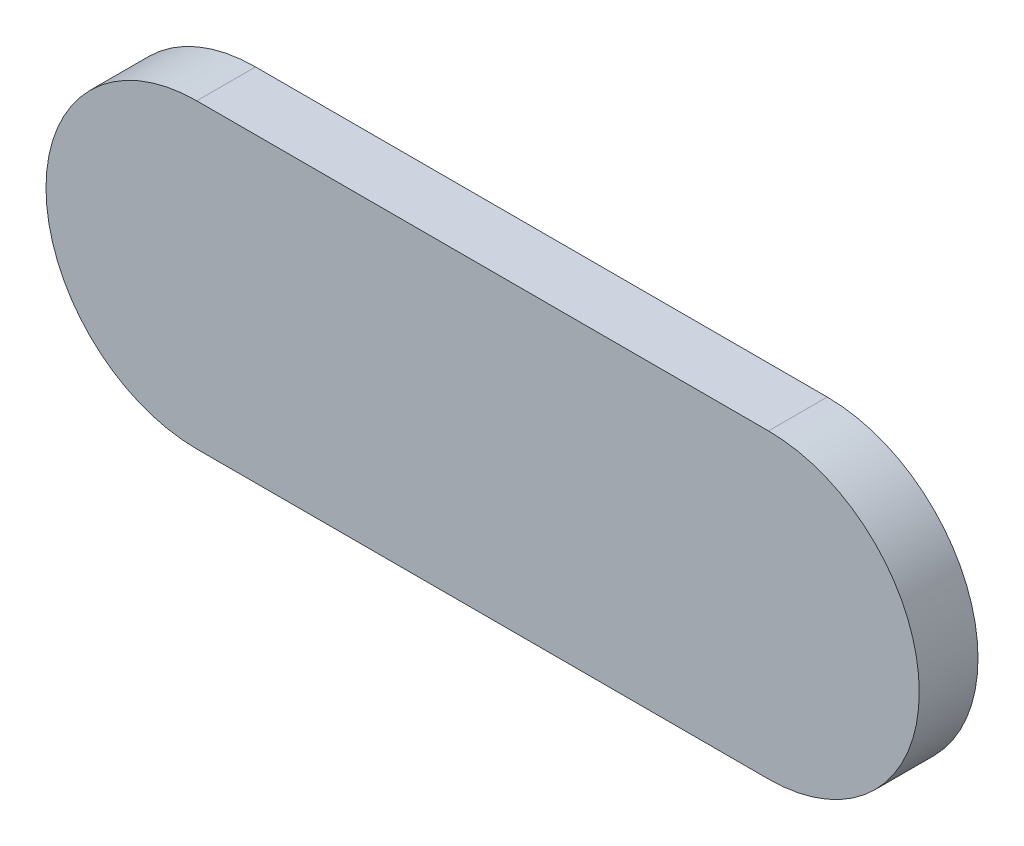
ISO-10303-21;
HEADER;
FILE_DESCRIPTION(('STEP AP214'),'2;1');
FILE_NAME('part.step','',(''),(''),'','','');
FILE_SCHEMA(('AUTOMOTIVE_DESIGN { 1 0 10303 214 1 1 1 1 }'));
ENDSEC;
DATA;
#1=APPLICATION_CONTEXT('core data for automotive mechanical design processes');
#2=APPLICATION_PROTOCOL_DEFINITION('international standard','automotive_design',2000,#1);
#3=PRODUCT_CONTEXT('',#1,'mechanical');
#4=PRODUCT('Part','Part','',(#3));
#5=PRODUCT_RELATED_PRODUCT_CATEGORY('part','',(#4));
#6=PRODUCT_DEFINITION_FORMATION('','',#4);
#7=PRODUCT_DEFINITION_CONTEXT('part definition',#1,'design');
#8=PRODUCT_DEFINITION('design','',#6,#7);
#9=PRODUCT_DEFINITION_SHAPE('','',#8);
#10=(LENGTH_UNIT() NAMED_UNIT(*) SI_UNIT(.MILLI.,.METRE.));
#11=(NAMED_UNIT(*) PLANE_ANGLE_UNIT() SI_UNIT($,.RADIAN.));
#12=(NAMED_UNIT(*) SI_UNIT($,.STERADIAN.) SOLID_ANGLE_UNIT());
#13=UNCERTAINTY_MEASURE_WITH_UNIT(LENGTH_MEASURE(1.E-05),#10,'distance_accuracy_value','');
#14=(GEOMETRIC_REPRESENTATION_CONTEXT(3) GLOBAL_UNCERTAINTY_ASSIGNED_CONTEXT((#13)) GLOBAL_UNIT_ASSIGNED_CONTEXT((#10,
#11,#12)) REPRESENTATION_CONTEXT('',''));
#15=CARTESIAN_POINT('',(0.,0.,0.));
#16=DIRECTION('',(0.,0.,1.));
#17=DIRECTION('',(1.,0.,0.));
#18=AXIS2_PLACEMENT_3D('',#15,#16,#17);
#19=CARTESIAN_POINT('',(7.3,0.,0.));
#20=DIRECTION('',(0.,0.,1.));
#21=DIRECTION('',(1.,0.,0.));
#22=AXIS2_PLACEMENT_3D('',#19,#20,#21);
#23=PLANE('',#22);
#24=CARTESIAN_POINT('',(7.3,0.,0.));
#25=DIRECTION('',(0.,0.,1.));
#26=DIRECTION('',(1.,0.,0.));
#27=AXIS2_PLACEMENT_3D('',#24,#25,#26);
#28=CIRCLE('',#27,3.85);
#29=CARTESIAN_POINT('',(7.3,-3.85,0.));
#30=VERTEX_POINT('',#29);
#31=CARTESIAN_POINT('',(7.3,3.85,0.));
#32=VERTEX_POINT('',#31);
#33=EDGE_CURVE('E121',#30,#32,#28,.T.);
#34=ORIENTED_EDGE('',*,*,#33,.F.);
#35=DIRECTION('',(1.,0.,0.));
#36=VECTOR('',#35,1.);
#37=CARTESIAN_POINT('',(-7.3,-3.85,0.));
#38=LINE('',#37,#36);
#39=CARTESIAN_POINT('',(-7.3,-3.85,0.));
#40=VERTEX_POINT('',#39);
#41=EDGE_CURVE('E134',#40,#30,#38,.T.);
#42=ORIENTED_EDGE('',*,*,#41,.F.);
#43=CARTESIAN_POINT('',(-7.3,0.,0.));
#44=DIRECTION('',(0.,0.,1.));
#45=DIRECTION('',(1.,0.,0.));
#46=AXIS2_PLACEMENT_3D('',#43,#44,#45);
#47=CIRCLE('',#46,3.85);
#48=CARTESIAN_POINT('',(-7.3,3.85,0.));
#49=VERTEX_POINT('',#48);
#50=EDGE_CURVE('E142',#49,#40,#47,.T.);
#51=ORIENTED_EDGE('',*,*,#50,.F.);
#52=DIRECTION('',(-1.,0.,0.));
#53=VECTOR('',#52,1.);
#54=CARTESIAN_POINT('',(7.3,3.85,0.));
#55=LINE('',#54,#53);
#56=EDGE_CURVE('E124',#32,#49,#55,.T.);
#57=ORIENTED_EDGE('',*,*,#56,.F.);
#58=EDGE_LOOP('',(#34,#42,#51,#57));
#59=FACE_BOUND('',#58,.T.);
#60=CARTESIAN_POINT('',(7.35,0.,0.));
#61=DIRECTION('',(0.,0.,-1.));
#62=DIRECTION('',(1.,0.,0.));
#63=AXIS2_PLACEMENT_3D('',#60,#61,#62);
#64=CIRCLE('',#63,2.3);
#65=CARTESIAN_POINT('',(7.35,2.3,0.));
#66=VERTEX_POINT('',#65);
#67=CARTESIAN_POINT('',(7.35,-2.3,0.));
#68=VERTEX_POINT('',#67);
#69=EDGE_CURVE('E51',#66,#68,#64,.T.);
#70=ORIENTED_EDGE('',*,*,#69,.F.);
#71=DIRECTION('',(1.,0.,0.));
#72=VECTOR('',#71,1.);
#73=CARTESIAN_POINT('',(7.35,2.3,0.));
#74=LINE('',#73,#72);
#75=CARTESIAN_POINT('',(-7.35,2.3,0.));
#76=VERTEX_POINT('',#75);
#77=EDGE_CURVE('E55',#76,#66,#74,.T.);
#78=ORIENTED_EDGE('',*,*,#77,.F.);
#79=CARTESIAN_POINT('',(-7.35,0.,0.));
#80=DIRECTION('',(0.,0.,-1.));
#81=DIRECTION('',(-1.,0.,0.));
#82=AXIS2_PLACEMENT_3D('',#79,#80,#81);
#83=CIRCLE('',#82,2.3);
#84=CARTESIAN_POINT('',(-7.35,-2.3,0.));
#85=VERTEX_POINT('',#84);
#86=EDGE_CURVE('E241',#85,#76,#83,.T.);
#87=ORIENTED_EDGE('',*,*,#86,.F.);
#88=DIRECTION('',(-1.,0.,0.));
#89=VECTOR('',#88,1.);
#90=CARTESIAN_POINT('',(7.35,-2.3,0.));
#91=LINE('',#90,#89);
#92=EDGE_CURVE('E247',#68,#85,#91,.T.);
#93=ORIENTED_EDGE('',*,*,#92,.F.);
#94=EDGE_LOOP('',(#70,#78,#87,#93));
#95=FACE_BOUND('',#94,.T.);
#96=ADVANCED_FACE('F36',(#59,#95),#23,.F.);
#97=CARTESIAN_POINT('',(7.3,0.,1.5));
#98=DIRECTION('',(0.,0.,-1.));
#99=DIRECTION('',(-1.,0.,0.));
#100=AXIS2_PLACEMENT_3D('',#97,#98,#99);
#101=CYLINDRICAL_SURFACE('',#100,3.85);
#102=ORIENTED_EDGE('',*,*,#33,.T.);
#103=DIRECTION('',(0.,0.,-1.));
#104=VECTOR('',#103,1.);
#105=CARTESIAN_POINT('',(7.3,3.85,1.5));
#106=LINE('',#105,#104);
#107=CARTESIAN_POINT('',(7.3,3.85,1.5));
#108=VERTEX_POINT('',#107);
#109=EDGE_CURVE('E153',#108,#32,#106,.T.);
#110=ORIENTED_EDGE('',*,*,#109,.F.);
#111=CARTESIAN_POINT('',(7.3,0.,1.5));
#112=DIRECTION('',(0.,0.,1.));
#113=DIRECTION('',(1.,0.,0.));
#114=AXIS2_PLACEMENT_3D('',#111,#112,#113);
#115=CIRCLE('',#114,3.85);
#116=CARTESIAN_POINT('',(7.3,-3.85,1.5));
#117=VERTEX_POINT('',#116);
#118=EDGE_CURVE('E130',#117,#108,#115,.T.);
#119=ORIENTED_EDGE('',*,*,#118,.F.);
#120=DIRECTION('',(0.,0.,-1.));
#121=VECTOR('',#120,1.);
#122=CARTESIAN_POINT('',(7.3,-3.85,1.5));
#123=LINE('',#122,#121);
#124=EDGE_CURVE('E139',#117,#30,#123,.T.);
#125=ORIENTED_EDGE('',*,*,#124,.T.);
#126=EDGE_LOOP('',(#102,#110,#119,#125));
#127=FACE_BOUND('',#126,.T.);
#128=ADVANCED_FACE('F38',(#127),#101,.T.);
#129=CARTESIAN_POINT('',(7.3,3.85,1.5));
#130=DIRECTION('',(0.,-1.,0.));
#131=DIRECTION('',(1.,0.,0.));
#132=AXIS2_PLACEMENT_3D('',#129,#130,#131);
#133=PLANE('',#132);
#134=ORIENTED_EDGE('',*,*,#56,.T.);
#135=DIRECTION('',(0.,0.,-1.));
#136=VECTOR('',#135,1.);
#137=CARTESIAN_POINT('',(-7.3,3.85,1.5));
#138=LINE('',#137,#136);
#139=CARTESIAN_POINT('',(-7.3,3.85,1.5));
#140=VERTEX_POINT('',#139);
#141=EDGE_CURVE('E150',#140,#49,#138,.T.);
#142=ORIENTED_EDGE('',*,*,#141,.F.);
#143=DIRECTION('',(-1.,0.,0.));
#144=VECTOR('',#143,1.);
#145=CARTESIAN_POINT('',(7.3,3.85,1.5));
#146=LINE('',#145,#144);
#147=EDGE_CURVE('E133',#108,#140,#146,.T.);
#148=ORIENTED_EDGE('',*,*,#147,.F.);
#149=ORIENTED_EDGE('',*,*,#109,.T.);
#150=EDGE_LOOP('',(#134,#142,#148,#149));
#151=FACE_BOUND('',#150,.T.);
#152=ADVANCED_FACE('F193',(#151),#133,.F.);
#153=CARTESIAN_POINT('',(-7.3,0.,1.5));
#154=DIRECTION('',(0.,0.,-1.));
#155=DIRECTION('',(-1.,0.,0.));
#156=AXIS2_PLACEMENT_3D('',#153,#154,#155);
#157=CYLINDRICAL_SURFACE('',#156,3.85);
#158=ORIENTED_EDGE('',*,*,#50,.T.);
#159=DIRECTION('',(0.,0.,-1.));
#160=VECTOR('',#159,1.);
#161=CARTESIAN_POINT('',(-7.3,-3.85,1.5));
#162=LINE('',#161,#160);
#163=CARTESIAN_POINT('',(-7.3,-3.85,1.5));
#164=VERTEX_POINT('',#163);
#165=EDGE_CURVE('E147',#164,#40,#162,.T.);
#166=ORIENTED_EDGE('',*,*,#165,.F.);
#167=CARTESIAN_POINT('',(-7.3,0.,1.5));
#168=DIRECTION('',(0.,0.,1.));
#169=DIRECTION('',(1.,0.,0.));
#170=AXIS2_PLACEMENT_3D('',#167,#168,#169);
#171=CIRCLE('',#170,3.85);
#172=EDGE_CURVE('E136',#140,#164,#171,.T.);
#173=ORIENTED_EDGE('',*,*,#172,.F.);
#174=ORIENTED_EDGE('',*,*,#141,.T.);
#175=EDGE_LOOP('',(#158,#166,#173,#174));
#176=FACE_BOUND('',#175,.T.);
#177=ADVANCED_FACE('F203',(#176),#157,.T.);
#178=CARTESIAN_POINT('',(-7.3,-3.85,1.5));
#179=DIRECTION('',(0.,1.,0.));
#180=DIRECTION('',(0.,0.,1.));
#181=AXIS2_PLACEMENT_3D('',#178,#179,#180);
#182=PLANE('',#181);
#183=ORIENTED_EDGE('',*,*,#41,.T.);
#184=ORIENTED_EDGE('',*,*,#124,.F.);
#185=DIRECTION('',(1.,0.,0.));
#186=VECTOR('',#185,1.);
#187=CARTESIAN_POINT('',(-7.3,-3.85,1.5));
#188=LINE('',#187,#186);
#189=EDGE_CURVE('E138',#164,#117,#188,.T.);
#190=ORIENTED_EDGE('',*,*,#189,.F.);
#191=ORIENTED_EDGE('',*,*,#165,.T.);
#192=EDGE_LOOP('',(#183,#184,#190,#191));
#193=FACE_BOUND('',#192,.T.);
#194=ADVANCED_FACE('F200',(#193),#182,.F.);
#195=CARTESIAN_POINT('',(7.3,0.,1.5));
#196=DIRECTION('',(0.,0.,1.));
#197=DIRECTION('',(1.,0.,0.));
#198=AXIS2_PLACEMENT_3D('',#195,#196,#197);
#199=PLANE('',#198);
#200=ORIENTED_EDGE('',*,*,#118,.T.);
#201=ORIENTED_EDGE('',*,*,#147,.T.);
#202=ORIENTED_EDGE('',*,*,#172,.T.);
#203=ORIENTED_EDGE('',*,*,#189,.T.);
#204=EDGE_LOOP('',(#200,#201,#202,#203));
#205=FACE_BOUND('',#204,.T.);
#206=ADVANCED_FACE('F198',(#205),#199,.T.);
#207=CARTESIAN_POINT('',(7.35,0.,-0.5));
#208=DIRECTION('',(0.,0.,1.));
#209=DIRECTION('',(1.,0.,0.));
#210=AXIS2_PLACEMENT_3D('',#207,#208,#209);
#211=CYLINDRICAL_SURFACE('',#210,2.3);
#212=ORIENTED_EDGE('',*,*,#69,.T.);
#213=DIRECTION('',(0.,0.,1.));
#214=VECTOR('',#213,1.);
#215=CARTESIAN_POINT('',(7.35,-2.3,-0.5));
#216=LINE('',#215,#214);
#217=CARTESIAN_POINT('',(7.35,-2.3,-0.5));
#218=VERTEX_POINT('',#217);
#219=EDGE_CURVE('E104',#218,#68,#216,.T.);
#220=ORIENTED_EDGE('',*,*,#219,.F.);
#221=CARTESIAN_POINT('',(7.35,0.,-0.5));
#222=DIRECTION('',(0.,0.,-1.));
#223=DIRECTION('',(1.,0.,0.));
#224=AXIS2_PLACEMENT_3D('',#221,#222,#223);
#225=CIRCLE('',#224,2.3);
#226=CARTESIAN_POINT('',(7.35,2.3,-0.5));
#227=VERTEX_POINT('',#226);
#228=EDGE_CURVE('E110',#227,#218,#225,.T.);
#229=ORIENTED_EDGE('',*,*,#228,.F.);
#230=DIRECTION('',(0.,0.,1.));
#231=VECTOR('',#230,1.);
#232=CARTESIAN_POINT('',(7.35,2.3,-0.5));
#233=LINE('',#232,#231);
#234=EDGE_CURVE('E239',#227,#66,#233,.T.);
#235=ORIENTED_EDGE('',*,*,#234,.T.);
#236=EDGE_LOOP('',(#212,#220,#229,#235));
#237=FACE_BOUND('',#236,.T.);
#238=ADVANCED_FACE('F120',(#237),#211,.T.);
#239=CARTESIAN_POINT('',(7.35,-2.3,-0.5));
#240=DIRECTION('',(0.,1.,0.));
#241=DIRECTION('',(0.,0.,1.));
#242=AXIS2_PLACEMENT_3D('',#239,#240,#241);
#243=PLANE('',#242);
#244=ORIENTED_EDGE('',*,*,#92,.T.);
#245=DIRECTION('',(0.,0.,1.));
#246=VECTOR('',#245,1.);
#247=CARTESIAN_POINT('',(-7.35,-2.3,-0.5));
#248=LINE('',#247,#246);
#249=CARTESIAN_POINT('',(-7.35,-2.3,-0.5));
#250=VERTEX_POINT('',#249);
#251=EDGE_CURVE('E106',#250,#85,#248,.T.);
#252=ORIENTED_EDGE('',*,*,#251,.F.);
#253=DIRECTION('',(-1.,0.,0.));
#254=VECTOR('',#253,1.);
#255=CARTESIAN_POINT('',(7.35,-2.3,-0.5));
#256=LINE('',#255,#254);
#257=EDGE_CURVE('E99',#218,#250,#256,.T.);
#258=ORIENTED_EDGE('',*,*,#257,.F.);
#259=ORIENTED_EDGE('',*,*,#219,.T.);
#260=EDGE_LOOP('',(#244,#252,#258,#259));
#261=FACE_BOUND('',#260,.T.);
#262=ADVANCED_FACE('F102',(#261),#243,.F.);
#263=CARTESIAN_POINT('',(-7.35,0.,-0.5));
#264=DIRECTION('',(0.,0.,1.));
#265=DIRECTION('',(1.,0.,0.));
#266=AXIS2_PLACEMENT_3D('',#263,#264,#265);
#267=CYLINDRICAL_SURFACE('',#266,2.3);
#268=ORIENTED_EDGE('',*,*,#86,.T.);
#269=DIRECTION('',(0.,0.,1.));
#270=VECTOR('',#269,1.);
#271=CARTESIAN_POINT('',(-7.35,2.3,-0.5));
#272=LINE('',#271,#270);
#273=CARTESIAN_POINT('',(-7.35,2.3,-0.5));
#274=VERTEX_POINT('',#273);
#275=EDGE_CURVE('E126',#274,#76,#272,.T.);
#276=ORIENTED_EDGE('',*,*,#275,.F.);
#277=CARTESIAN_POINT('',(-7.35,0.,-0.5));
#278=DIRECTION('',(0.,0.,-1.));
#279=DIRECTION('',(-1.,0.,0.));
#280=AXIS2_PLACEMENT_3D('',#277,#278,#279);
#281=CIRCLE('',#280,2.3);
#282=EDGE_CURVE('E109',#250,#274,#281,.T.);
#283=ORIENTED_EDGE('',*,*,#282,.F.);
#284=ORIENTED_EDGE('',*,*,#251,.T.);
#285=EDGE_LOOP('',(#268,#276,#283,#284));
#286=FACE_BOUND('',#285,.T.);
#287=ADVANCED_FACE('F228',(#286),#267,.T.);
#288=CARTESIAN_POINT('',(7.35,2.3,-0.5));
#289=DIRECTION('',(0.,-1.,0.));
#290=DIRECTION('',(0.,0.,-1.));
#291=AXIS2_PLACEMENT_3D('',#288,#289,#290);
#292=PLANE('',#291);
#293=ORIENTED_EDGE('',*,*,#77,.T.);
#294=ORIENTED_EDGE('',*,*,#234,.F.);
#295=DIRECTION('',(1.,0.,0.));
#296=VECTOR('',#295,1.);
#297=CARTESIAN_POINT('',(7.35,2.3,-0.5));
#298=LINE('',#297,#296);
#299=EDGE_CURVE('E115',#274,#227,#298,.T.);
#300=ORIENTED_EDGE('',*,*,#299,.F.);
#301=ORIENTED_EDGE('',*,*,#275,.T.);
#302=EDGE_LOOP('',(#293,#294,#300,#301));
#303=FACE_BOUND('',#302,.T.);
#304=ADVANCED_FACE('F169',(#303),#292,.F.);
#305=CARTESIAN_POINT('',(7.35,0.,-0.5));
#306=DIRECTION('',(0.,0.,1.));
#307=DIRECTION('',(1.,0.,0.));
#308=AXIS2_PLACEMENT_3D('',#305,#306,#307);
#309=PLANE('',#308);
#310=CARTESIAN_POINT('',(1.27,0.,-0.5));
#311=DIRECTION('',(0.,0.,1.));
#312=DIRECTION('',(1.,0.,0.));
#313=AXIS2_PLACEMENT_3D('',#310,#311,#312);
#314=CIRCLE('',#313,0.75);
#315=CARTESIAN_POINT('',(2.02,0.,-0.5));
#316=VERTEX_POINT('',#315);
#317=EDGE_CURVE('E11',#316,#316,#314,.F.);
#318=ORIENTED_EDGE('',*,*,#317,.F.);
#319=EDGE_LOOP('',(#318));
#320=FACE_BOUND('',#319,.T.);
#321=CARTESIAN_POINT('',(3.81,0.,-0.5));
#322=DIRECTION('',(0.,0.,1.));
#323=DIRECTION('',(1.,0.,0.));
#324=AXIS2_PLACEMENT_3D('',#321,#322,#323);
#325=CIRCLE('',#324,0.750000000000001);
#326=CARTESIAN_POINT('',(4.56,0.,-0.5));
#327=VERTEX_POINT('',#326);
#328=EDGE_CURVE('E44',#327,#327,#325,.F.);
#329=ORIENTED_EDGE('',*,*,#328,.F.);
#330=EDGE_LOOP('',(#329));
#331=FACE_BOUND('',#330,.T.);
#332=CARTESIAN_POINT('',(-3.81,0.,-0.5));
#333=DIRECTION('',(0.,0.,1.));
#334=DIRECTION('',(1.,0.,0.));
#335=AXIS2_PLACEMENT_3D('',#332,#333,#334);
#336=CIRCLE('',#335,0.750000000000001);
#337=CARTESIAN_POINT('',(-3.06,0.,-0.5));
#338=VERTEX_POINT('',#337);
#339=EDGE_CURVE('E159',#338,#338,#336,.F.);
#340=ORIENTED_EDGE('',*,*,#339,.F.);
#341=EDGE_LOOP('',(#340));
#342=FACE_BOUND('',#341,.T.);
#343=CARTESIAN_POINT('',(-1.27,0.,-0.5));
#344=DIRECTION('',(0.,0.,1.));
#345=DIRECTION('',(1.,0.,0.));
#346=AXIS2_PLACEMENT_3D('',#343,#344,#345);
#347=CIRCLE('',#346,0.75);
#348=CARTESIAN_POINT('',(-0.52,0.,-0.5));
#349=VERTEX_POINT('',#348);
#350=EDGE_CURVE('E156',#349,#349,#347,.F.);
#351=ORIENTED_EDGE('',*,*,#350,.F.);
#352=EDGE_LOOP('',(#351));
#353=FACE_BOUND('',#352,.T.);
#354=ORIENTED_EDGE('',*,*,#228,.T.);
#355=ORIENTED_EDGE('',*,*,#257,.T.);
#356=ORIENTED_EDGE('',*,*,#282,.T.);
#357=ORIENTED_EDGE('',*,*,#299,.T.);
#358=EDGE_LOOP('',(#354,#355,#356,#357));
#359=FACE_BOUND('',#358,.T.);
#360=ADVANCED_FACE('F113',(#320,#331,#342,#353,#359),#309,.F.);
#361=CARTESIAN_POINT('',(-1.27,0.,-0.7));
#362=DIRECTION('',(0.,0.,1.));
#363=DIRECTION('',(1.,0.,0.));
#364=AXIS2_PLACEMENT_3D('',#361,#362,#363);
#365=CYLINDRICAL_SURFACE('',#364,0.75);
#366=CARTESIAN_POINT('',(-1.27,0.,-0.7));
#367=DIRECTION('',(0.,0.,-1.));
#368=DIRECTION('',(-1.,0.,0.));
#369=AXIS2_PLACEMENT_3D('',#366,#367,#368);
#370=CIRCLE('',#369,0.75);
#371=CARTESIAN_POINT('',(-2.02,0.,-0.7));
#372=VERTEX_POINT('',#371);
#373=EDGE_CURVE('E249',#372,#372,#370,.T.);
#374=ORIENTED_EDGE('',*,*,#373,.F.);
#375=EDGE_LOOP('',(#374));
#376=FACE_BOUND('',#375,.T.);
#377=ORIENTED_EDGE('',*,*,#350,.T.);
#378=EDGE_LOOP('',(#377));
#379=FACE_BOUND('',#378,.T.);
#380=ADVANCED_FACE('F168',(#376,#379),#365,.T.);
#381=CARTESIAN_POINT('',(-1.27,0.,-0.7));
#382=DIRECTION('',(0.,0.,-1.));
#383=DIRECTION('',(-1.,0.,0.));
#384=AXIS2_PLACEMENT_3D('',#381,#382,#383);
#385=PLANE('',#384);
#386=ORIENTED_EDGE('',*,*,#373,.T.);
#387=EDGE_LOOP('',(#386));
#388=FACE_BOUND('',#387,.T.);
#389=ADVANCED_FACE('F177',(#388),#385,.T.);
#390=CARTESIAN_POINT('',(-3.81,0.,-0.7));
#391=DIRECTION('',(0.,0.,1.));
#392=DIRECTION('',(1.,0.,0.));
#393=AXIS2_PLACEMENT_3D('',#390,#391,#392);
#394=CYLINDRICAL_SURFACE('',#393,0.750000000000001);
#395=CARTESIAN_POINT('',(-3.81,0.,-0.7));
#396=DIRECTION('',(0.,0.,-1.));
#397=DIRECTION('',(-1.,0.,0.));
#398=AXIS2_PLACEMENT_3D('',#395,#396,#397);
#399=CIRCLE('',#398,0.750000000000001);
#400=CARTESIAN_POINT('',(-4.56,0.,-0.7));
#401=VERTEX_POINT('',#400);
#402=EDGE_CURVE('E254',#401,#401,#399,.T.);
#403=ORIENTED_EDGE('',*,*,#402,.F.);
#404=EDGE_LOOP('',(#403));
#405=FACE_BOUND('',#404,.T.);
#406=ORIENTED_EDGE('',*,*,#339,.T.);
#407=EDGE_LOOP('',(#406));
#408=FACE_BOUND('',#407,.T.);
#409=ADVANCED_FACE('F183',(#405,#408),#394,.T.);
#410=CARTESIAN_POINT('',(-3.81,0.,-0.7));
#411=DIRECTION('',(0.,0.,-1.));
#412=DIRECTION('',(-1.,0.,0.));
#413=AXIS2_PLACEMENT_3D('',#410,#411,#412);
#414=PLANE('',#413);
#415=ORIENTED_EDGE('',*,*,#402,.T.);
#416=EDGE_LOOP('',(#415));
#417=FACE_BOUND('',#416,.T.);
#418=ADVANCED_FACE('F282',(#417),#414,.T.);
#419=CARTESIAN_POINT('',(3.81,0.,-0.7));
#420=DIRECTION('',(0.,0.,1.));
#421=DIRECTION('',(1.,0.,0.));
#422=AXIS2_PLACEMENT_3D('',#419,#420,#421);
#423=CYLINDRICAL_SURFACE('',#422,0.750000000000001);
#424=CARTESIAN_POINT('',(3.81,0.,-0.7));
#425=DIRECTION('',(0.,0.,-1.));
#426=DIRECTION('',(1.,0.,0.));
#427=AXIS2_PLACEMENT_3D('',#424,#425,#426);
#428=CIRCLE('',#427,0.750000000000001);
#429=CARTESIAN_POINT('',(4.56,0.,-0.7));
#430=VERTEX_POINT('',#429);
#431=EDGE_CURVE('E257',#430,#430,#428,.T.);
#432=ORIENTED_EDGE('',*,*,#431,.F.);
#433=EDGE_LOOP('',(#432));
#434=FACE_BOUND('',#433,.T.);
#435=ORIENTED_EDGE('',*,*,#328,.T.);
#436=EDGE_LOOP('',(#435));
#437=FACE_BOUND('',#436,.T.);
#438=ADVANCED_FACE('F164',(#434,#437),#423,.T.);
#439=CARTESIAN_POINT('',(3.81,0.,-0.7));
#440=DIRECTION('',(0.,0.,1.));
#441=DIRECTION('',(1.,0.,0.));
#442=AXIS2_PLACEMENT_3D('',#439,#440,#441);
#443=PLANE('',#442);
#444=ORIENTED_EDGE('',*,*,#431,.T.);
#445=EDGE_LOOP('',(#444));
#446=FACE_BOUND('',#445,.T.);
#447=ADVANCED_FACE('F269',(#446),#443,.F.);
#448=CARTESIAN_POINT('',(1.27,0.,-0.7));
#449=DIRECTION('',(0.,0.,1.));
#450=DIRECTION('',(1.,0.,0.));
#451=AXIS2_PLACEMENT_3D('',#448,#449,#450);
#452=CYLINDRICAL_SURFACE('',#451,0.75);
#453=CARTESIAN_POINT('',(1.27,0.,-0.7));
#454=DIRECTION('',(0.,0.,-1.));
#455=DIRECTION('',(1.,0.,0.));
#456=AXIS2_PLACEMENT_3D('',#453,#454,#455);
#457=CIRCLE('',#456,0.75);
#458=CARTESIAN_POINT('',(2.02,0.,-0.7));
#459=VERTEX_POINT('',#458);
#460=EDGE_CURVE('E260',#459,#459,#457,.T.);
#461=ORIENTED_EDGE('',*,*,#460,.F.);
#462=EDGE_LOOP('',(#461));
#463=FACE_BOUND('',#462,.T.);
#464=ORIENTED_EDGE('',*,*,#317,.T.);
#465=EDGE_LOOP('',(#464));
#466=FACE_BOUND('',#465,.T.);
#467=ADVANCED_FACE('F266',(#463,#466),#452,.T.);
#468=CARTESIAN_POINT('',(1.27,0.,-0.7));
#469=DIRECTION('',(0.,0.,1.));
#470=DIRECTION('',(1.,0.,0.));
#471=AXIS2_PLACEMENT_3D('',#468,#469,#470);
#472=PLANE('',#471);
#473=ORIENTED_EDGE('',*,*,#460,.T.);
#474=EDGE_LOOP('',(#473));
#475=FACE_BOUND('',#474,.T.);
#476=ADVANCED_FACE('F264',(#475),#472,.F.);
#477=CLOSED_SHELL('',(#96,#128,#152,#177,#194,#206,#238,#262,#287,#304,#360,#380,#389,#409,#418,
#438,#447,#467,#476));
#478=MANIFOLD_SOLID_BREP('B2',#477);
#479=ADVANCED_BREP_SHAPE_REPRESENTATION('',(#18,#478),#14);
#480=SHAPE_DEFINITION_REPRESENTATION(#9,#479);
ENDSEC;
END-ISO-10303-21;
